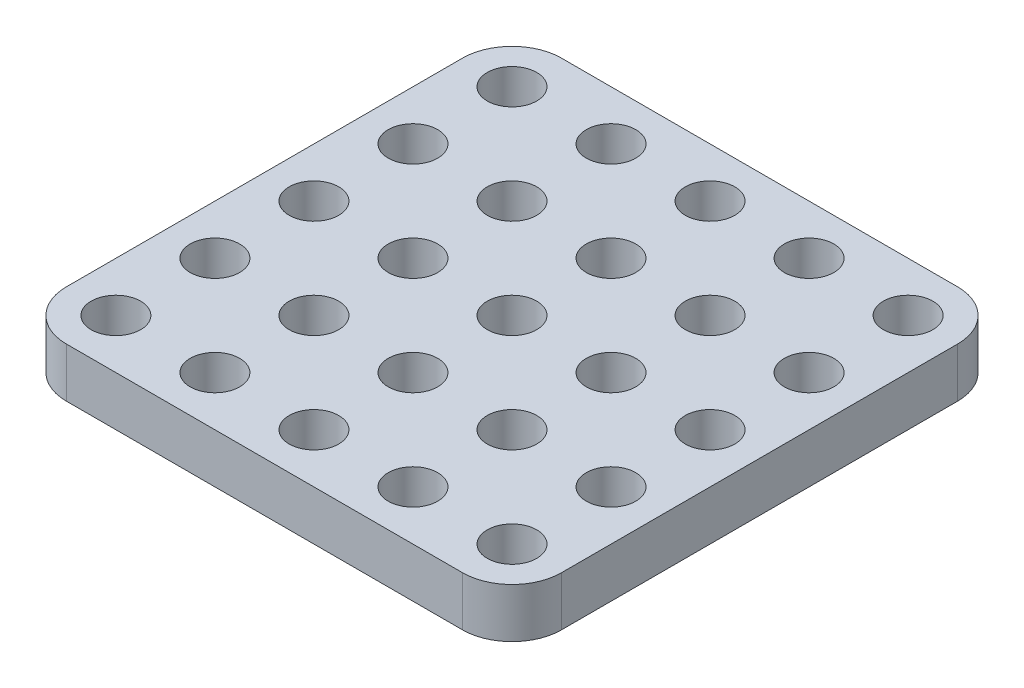
ISO-10303-21;
HEADER;
FILE_DESCRIPTION(('STEP AP214'),'2;1');
FILE_NAME('part.step','',(''),(''),'','','');
FILE_SCHEMA(('AUTOMOTIVE_DESIGN { 1 0 10303 214 1 1 1 1 }'));
ENDSEC;
DATA;
#1=APPLICATION_CONTEXT('core data for automotive mechanical design processes');
#2=APPLICATION_PROTOCOL_DEFINITION('international standard','automotive_design',2000,#1);
#3=PRODUCT_CONTEXT('',#1,'mechanical');
#4=PRODUCT('Part','Part','',(#3));
#5=PRODUCT_RELATED_PRODUCT_CATEGORY('part','',(#4));
#6=PRODUCT_DEFINITION_FORMATION('','',#4);
#7=PRODUCT_DEFINITION_CONTEXT('part definition',#1,'design');
#8=PRODUCT_DEFINITION('design','',#6,#7);
#9=PRODUCT_DEFINITION_SHAPE('','',#8);
#10=(LENGTH_UNIT() NAMED_UNIT(*) SI_UNIT(.MILLI.,.METRE.));
#11=(NAMED_UNIT(*) PLANE_ANGLE_UNIT() SI_UNIT($,.RADIAN.));
#12=(NAMED_UNIT(*) SI_UNIT($,.STERADIAN.) SOLID_ANGLE_UNIT());
#13=UNCERTAINTY_MEASURE_WITH_UNIT(LENGTH_MEASURE(1.E-05),#10,'distance_accuracy_value','');
#14=(GEOMETRIC_REPRESENTATION_CONTEXT(3) GLOBAL_UNCERTAINTY_ASSIGNED_CONTEXT((#13)) GLOBAL_UNIT_ASSIGNED_CONTEXT((#10,
#11,#12)) REPRESENTATION_CONTEXT('',''));
#15=CARTESIAN_POINT('',(0.,0.,0.));
#16=DIRECTION('',(0.,0.,1.));
#17=DIRECTION('',(1.,0.,0.));
#18=AXIS2_PLACEMENT_3D('',#15,#16,#17);
#19=CARTESIAN_POINT('',(20.,5.,-20.));
#20=DIRECTION('',(0.,-1.,0.));
#21=DIRECTION('',(0.,0.,-1.));
#22=AXIS2_PLACEMENT_3D('',#19,#20,#21);
#23=PLANE('',#22);
#24=CARTESIAN_POINT('',(20.,5.,-20.));
#25=DIRECTION('',(0.,1.,0.));
#26=DIRECTION('',(0.,0.,-1.));
#27=AXIS2_PLACEMENT_3D('',#24,#25,#26);
#28=CIRCLE('',#27,5.);
#29=CARTESIAN_POINT('',(25.,5.,-20.));
#30=VERTEX_POINT('',#29);
#31=CARTESIAN_POINT('',(20.,5.,-25.));
#32=VERTEX_POINT('',#31);
#33=EDGE_CURVE('E145',#30,#32,#28,.T.);
#34=ORIENTED_EDGE('',*,*,#33,.T.);
#35=DIRECTION('',(-1.,0.,0.));
#36=VECTOR('',#35,1.);
#37=CARTESIAN_POINT('',(20.,5.,-25.));
#38=LINE('',#37,#36);
#39=CARTESIAN_POINT('',(-20.,5.,-25.));
#40=VERTEX_POINT('',#39);
#41=EDGE_CURVE('E93',#32,#40,#38,.T.);
#42=ORIENTED_EDGE('',*,*,#41,.T.);
#43=CARTESIAN_POINT('',(-20.,5.,-20.));
#44=DIRECTION('',(0.,1.,0.));
#45=DIRECTION('',(0.,0.,-1.));
#46=AXIS2_PLACEMENT_3D('',#43,#44,#45);
#47=CIRCLE('',#46,5.);
#48=CARTESIAN_POINT('',(-25.,5.,-20.));
#49=VERTEX_POINT('',#48);
#50=EDGE_CURVE('E160',#40,#49,#47,.T.);
#51=ORIENTED_EDGE('',*,*,#50,.T.);
#52=DIRECTION('',(0.,0.,1.));
#53=VECTOR('',#52,1.);
#54=CARTESIAN_POINT('',(-25.,5.,20.));
#55=LINE('',#54,#53);
#56=CARTESIAN_POINT('',(-25.,5.,20.));
#57=VERTEX_POINT('',#56);
#58=EDGE_CURVE('E173',#49,#57,#55,.T.);
#59=ORIENTED_EDGE('',*,*,#58,.T.);
#60=CARTESIAN_POINT('',(-20.,5.,20.));
#61=DIRECTION('',(0.,1.,0.));
#62=DIRECTION('',(0.,0.,-1.));
#63=AXIS2_PLACEMENT_3D('',#60,#61,#62);
#64=CIRCLE('',#63,5.);
#65=CARTESIAN_POINT('',(-20.,5.,25.));
#66=VERTEX_POINT('',#65);
#67=EDGE_CURVE('E112',#57,#66,#64,.T.);
#68=ORIENTED_EDGE('',*,*,#67,.T.);
#69=DIRECTION('',(1.,0.,0.));
#70=VECTOR('',#69,1.);
#71=CARTESIAN_POINT('',(20.,5.,25.));
#72=LINE('',#71,#70);
#73=CARTESIAN_POINT('',(20.,5.,25.));
#74=VERTEX_POINT('',#73);
#75=EDGE_CURVE('E106',#66,#74,#72,.T.);
#76=ORIENTED_EDGE('',*,*,#75,.T.);
#77=CARTESIAN_POINT('',(20.,5.,20.));
#78=DIRECTION('',(0.,1.,0.));
#79=DIRECTION('',(0.,0.,-1.));
#80=AXIS2_PLACEMENT_3D('',#77,#78,#79);
#81=CIRCLE('',#80,5.);
#82=CARTESIAN_POINT('',(25.,5.,20.));
#83=VERTEX_POINT('',#82);
#84=EDGE_CURVE('E110',#74,#83,#81,.T.);
#85=ORIENTED_EDGE('',*,*,#84,.T.);
#86=DIRECTION('',(0.,0.,-1.));
#87=VECTOR('',#86,1.);
#88=CARTESIAN_POINT('',(25.,5.,20.));
#89=LINE('',#88,#87);
#90=EDGE_CURVE('E50',#83,#30,#89,.T.);
#91=ORIENTED_EDGE('',*,*,#90,.T.);
#92=EDGE_LOOP('',(#34,#42,#51,#59,#68,#76,#85,#91));
#93=FACE_BOUND('',#92,.T.);
#94=CARTESIAN_POINT('',(-20.,5.,-20.));
#95=DIRECTION('',(0.,1.,0.));
#96=DIRECTION('',(0.,0.,1.));
#97=AXIS2_PLACEMENT_3D('',#94,#95,#96);
#98=CIRCLE('',#97,2.5);
#99=CARTESIAN_POINT('',(-20.,5.,-17.5));
#100=VERTEX_POINT('',#99);
#101=EDGE_CURVE('E134',#100,#100,#98,.T.);
#102=ORIENTED_EDGE('',*,*,#101,.F.);
#103=EDGE_LOOP('',(#102));
#104=FACE_BOUND('',#103,.T.);
#105=CARTESIAN_POINT('',(-10.,5.,-20.0000000000001));
#106=DIRECTION('',(0.,1.,0.));
#107=DIRECTION('',(0.,0.,1.));
#108=AXIS2_PLACEMENT_3D('',#105,#106,#107);
#109=CIRCLE('',#108,2.5);
#110=CARTESIAN_POINT('',(-10.,5.,-17.5000000000001));
#111=VERTEX_POINT('',#110);
#112=EDGE_CURVE('E182',#111,#111,#109,.T.);
#113=ORIENTED_EDGE('',*,*,#112,.F.);
#114=EDGE_LOOP('',(#113));
#115=FACE_BOUND('',#114,.T.);
#116=CARTESIAN_POINT('',(0.,5.,-20.0000000000003));
#117=DIRECTION('',(0.,1.,0.));
#118=DIRECTION('',(0.,0.,1.));
#119=AXIS2_PLACEMENT_3D('',#116,#117,#118);
#120=CIRCLE('',#119,2.5);
#121=CARTESIAN_POINT('',(0.,5.,-17.5000000000003));
#122=VERTEX_POINT('',#121);
#123=EDGE_CURVE('E188',#122,#122,#120,.T.);
#124=ORIENTED_EDGE('',*,*,#123,.F.);
#125=EDGE_LOOP('',(#124));
#126=FACE_BOUND('',#125,.T.);
#127=CARTESIAN_POINT('',(9.99999999999999,5.,-20.0000000000004));
#128=DIRECTION('',(0.,1.,0.));
#129=DIRECTION('',(0.,0.,1.));
#130=AXIS2_PLACEMENT_3D('',#127,#128,#129);
#131=CIRCLE('',#130,2.5);
#132=CARTESIAN_POINT('',(9.99999999999999,5.,-17.5000000000004));
#133=VERTEX_POINT('',#132);
#134=EDGE_CURVE('E194',#133,#133,#131,.T.);
#135=ORIENTED_EDGE('',*,*,#134,.F.);
#136=EDGE_LOOP('',(#135));
#137=FACE_BOUND('',#136,.T.);
#138=CARTESIAN_POINT('',(20.,5.,-20.0000000000006));
#139=DIRECTION('',(0.,1.,0.));
#140=DIRECTION('',(0.,0.,1.));
#141=AXIS2_PLACEMENT_3D('',#138,#139,#140);
#142=CIRCLE('',#141,2.5);
#143=CARTESIAN_POINT('',(20.,5.,-17.5000000000006));
#144=VERTEX_POINT('',#143);
#145=EDGE_CURVE('E200',#144,#144,#142,.T.);
#146=ORIENTED_EDGE('',*,*,#145,.F.);
#147=EDGE_LOOP('',(#146));
#148=FACE_BOUND('',#147,.T.);
#149=CARTESIAN_POINT('',(-9.9999999999999,5.,-10.0000000000001));
#150=DIRECTION('',(0.,1.,0.));
#151=DIRECTION('',(0.,0.,1.));
#152=AXIS2_PLACEMENT_3D('',#149,#150,#151);
#153=CIRCLE('',#152,2.5);
#154=CARTESIAN_POINT('',(-9.9999999999999,5.,-7.50000000000014));
#155=VERTEX_POINT('',#154);
#156=EDGE_CURVE('E206',#155,#155,#153,.T.);
#157=ORIENTED_EDGE('',*,*,#156,.F.);
#158=EDGE_LOOP('',(#157));
#159=FACE_BOUND('',#158,.T.);
#160=CARTESIAN_POINT('',(0.,5.,-10.0000000000003));
#161=DIRECTION('',(0.,1.,0.));
#162=DIRECTION('',(0.,0.,1.));
#163=AXIS2_PLACEMENT_3D('',#160,#161,#162);
#164=CIRCLE('',#163,2.5);
#165=CARTESIAN_POINT('',(0.,5.,-7.50000000000028));
#166=VERTEX_POINT('',#165);
#167=EDGE_CURVE('E212',#166,#166,#164,.T.);
#168=ORIENTED_EDGE('',*,*,#167,.F.);
#169=EDGE_LOOP('',(#168));
#170=FACE_BOUND('',#169,.T.);
#171=CARTESIAN_POINT('',(10.0000000000001,5.,-10.0000000000004));
#172=DIRECTION('',(0.,1.,0.));
#173=DIRECTION('',(0.,0.,1.));
#174=AXIS2_PLACEMENT_3D('',#171,#172,#173);
#175=CIRCLE('',#174,2.5);
#176=CARTESIAN_POINT('',(10.0000000000001,5.,-7.50000000000042));
#177=VERTEX_POINT('',#176);
#178=EDGE_CURVE('E218',#177,#177,#175,.T.);
#179=ORIENTED_EDGE('',*,*,#178,.F.);
#180=EDGE_LOOP('',(#179));
#181=FACE_BOUND('',#180,.T.);
#182=CARTESIAN_POINT('',(20.0000000000001,5.,-10.0000000000006));
#183=DIRECTION('',(0.,1.,0.));
#184=DIRECTION('',(0.,0.,1.));
#185=AXIS2_PLACEMENT_3D('',#182,#183,#184);
#186=CIRCLE('',#185,2.5);
#187=CARTESIAN_POINT('',(20.0000000000001,5.,-7.50000000000056));
#188=VERTEX_POINT('',#187);
#189=EDGE_CURVE('E224',#188,#188,#186,.T.);
#190=ORIENTED_EDGE('',*,*,#189,.F.);
#191=EDGE_LOOP('',(#190));
#192=FACE_BOUND('',#191,.T.);
#193=CARTESIAN_POINT('',(-9.99999999999979,5.,-1.42247325030098E-13));
#194=DIRECTION('',(0.,1.,0.));
#195=DIRECTION('',(0.,0.,1.));
#196=AXIS2_PLACEMENT_3D('',#193,#194,#195);
#197=CIRCLE('',#196,2.5);
#198=CARTESIAN_POINT('',(-9.99999999999979,5.,2.49999999999986));
#199=VERTEX_POINT('',#198);
#200=EDGE_CURVE('E230',#199,#199,#197,.T.);
#201=ORIENTED_EDGE('',*,*,#200,.F.);
#202=EDGE_LOOP('',(#201));
#203=FACE_BOUND('',#202,.T.);
#204=CARTESIAN_POINT('',(2.0122792321331E-13,5.,-2.84494650060196E-13));
#205=DIRECTION('',(0.,1.,0.));
#206=DIRECTION('',(0.,0.,1.));
#207=AXIS2_PLACEMENT_3D('',#204,#205,#206);
#208=CIRCLE('',#207,2.5);
#209=CARTESIAN_POINT('',(2.0122792321331E-13,5.,2.49999999999972));
#210=VERTEX_POINT('',#209);
#211=EDGE_CURVE('E236',#210,#210,#208,.T.);
#212=ORIENTED_EDGE('',*,*,#211,.F.);
#213=EDGE_LOOP('',(#212));
#214=FACE_BOUND('',#213,.T.);
#215=CARTESIAN_POINT('',(10.0000000000002,5.,-4.23272528138341E-13));
#216=DIRECTION('',(0.,1.,0.));
#217=DIRECTION('',(0.,0.,1.));
#218=AXIS2_PLACEMENT_3D('',#215,#216,#217);
#219=CIRCLE('',#218,2.5);
#220=CARTESIAN_POINT('',(10.0000000000002,5.,2.49999999999958));
#221=VERTEX_POINT('',#220);
#222=EDGE_CURVE('E242',#221,#221,#219,.T.);
#223=ORIENTED_EDGE('',*,*,#222,.F.);
#224=EDGE_LOOP('',(#223));
#225=FACE_BOUND('',#224,.T.);
#226=CARTESIAN_POINT('',(20.0000000000002,5.,-5.62050406216485E-13));
#227=DIRECTION('',(0.,1.,0.));
#228=DIRECTION('',(0.,0.,1.));
#229=AXIS2_PLACEMENT_3D('',#226,#227,#228);
#230=CIRCLE('',#229,2.5);
#231=CARTESIAN_POINT('',(20.0000000000002,5.,2.49999999999944));
#232=VERTEX_POINT('',#231);
#233=EDGE_CURVE('E248',#232,#232,#230,.T.);
#234=ORIENTED_EDGE('',*,*,#233,.F.);
#235=EDGE_LOOP('',(#234));
#236=FACE_BOUND('',#235,.T.);
#237=CARTESIAN_POINT('',(-9.99999999999969,5.,9.99999999999986));
#238=DIRECTION('',(0.,1.,0.));
#239=DIRECTION('',(0.,0.,1.));
#240=AXIS2_PLACEMENT_3D('',#237,#238,#239);
#241=CIRCLE('',#240,2.5);
#242=CARTESIAN_POINT('',(-9.99999999999969,5.,12.4999999999999));
#243=VERTEX_POINT('',#242);
#244=EDGE_CURVE('E254',#243,#243,#241,.T.);
#245=ORIENTED_EDGE('',*,*,#244,.F.);
#246=EDGE_LOOP('',(#245));
#247=FACE_BOUND('',#246,.T.);
#248=CARTESIAN_POINT('',(3.08780778723872E-13,5.,9.99999999999971));
#249=DIRECTION('',(0.,1.,0.));
#250=DIRECTION('',(0.,0.,1.));
#251=AXIS2_PLACEMENT_3D('',#248,#249,#250);
#252=CIRCLE('',#251,2.5);
#253=CARTESIAN_POINT('',(3.08780778723872E-13,5.,12.4999999999997));
#254=VERTEX_POINT('',#253);
#255=EDGE_CURVE('E260',#254,#254,#252,.T.);
#256=ORIENTED_EDGE('',*,*,#255,.F.);
#257=EDGE_LOOP('',(#256));
#258=FACE_BOUND('',#257,.T.);
#259=CARTESIAN_POINT('',(10.0000000000003,5.,9.99999999999958));
#260=DIRECTION('',(0.,1.,0.));
#261=DIRECTION('',(0.,0.,1.));
#262=AXIS2_PLACEMENT_3D('',#259,#260,#261);
#263=CIRCLE('',#262,2.5);
#264=CARTESIAN_POINT('',(10.0000000000003,5.,12.4999999999996));
#265=VERTEX_POINT('',#264);
#266=EDGE_CURVE('E266',#265,#265,#263,.T.);
#267=ORIENTED_EDGE('',*,*,#266,.F.);
#268=EDGE_LOOP('',(#267));
#269=FACE_BOUND('',#268,.T.);
#270=CARTESIAN_POINT('',(20.0000000000003,5.,9.99999999999944));
#271=DIRECTION('',(0.,1.,0.));
#272=DIRECTION('',(0.,0.,1.));
#273=AXIS2_PLACEMENT_3D('',#270,#271,#272);
#274=CIRCLE('',#273,2.5);
#275=CARTESIAN_POINT('',(20.0000000000003,5.,12.4999999999994));
#276=VERTEX_POINT('',#275);
#277=EDGE_CURVE('E272',#276,#276,#274,.T.);
#278=ORIENTED_EDGE('',*,*,#277,.F.);
#279=EDGE_LOOP('',(#278));
#280=FACE_BOUND('',#279,.T.);
#281=CARTESIAN_POINT('',(-9.99999999999958,5.,19.9999999999999));
#282=DIRECTION('',(0.,1.,0.));
#283=DIRECTION('',(0.,0.,1.));
#284=AXIS2_PLACEMENT_3D('',#281,#282,#283);
#285=CIRCLE('',#284,2.5);
#286=CARTESIAN_POINT('',(-9.99999999999958,5.,22.4999999999999));
#287=VERTEX_POINT('',#286);
#288=EDGE_CURVE('E278',#287,#287,#285,.T.);
#289=ORIENTED_EDGE('',*,*,#288,.F.);
#290=EDGE_LOOP('',(#289));
#291=FACE_BOUND('',#290,.T.);
#292=CARTESIAN_POINT('',(4.1286418728248E-13,5.,19.9999999999997));
#293=DIRECTION('',(0.,1.,0.));
#294=DIRECTION('',(0.,0.,1.));
#295=AXIS2_PLACEMENT_3D('',#292,#293,#294);
#296=CIRCLE('',#295,2.5);
#297=CARTESIAN_POINT('',(4.1286418728248E-13,5.,22.4999999999997));
#298=VERTEX_POINT('',#297);
#299=EDGE_CURVE('E284',#298,#298,#296,.T.);
#300=ORIENTED_EDGE('',*,*,#299,.F.);
#301=EDGE_LOOP('',(#300));
#302=FACE_BOUND('',#301,.T.);
#303=CARTESIAN_POINT('',(10.0000000000004,5.,19.9999999999996));
#304=DIRECTION('',(0.,1.,0.));
#305=DIRECTION('',(0.,0.,1.));
#306=AXIS2_PLACEMENT_3D('',#303,#304,#305);
#307=CIRCLE('',#306,2.5);
#308=CARTESIAN_POINT('',(10.0000000000004,5.,22.4999999999996));
#309=VERTEX_POINT('',#308);
#310=EDGE_CURVE('E290',#309,#309,#307,.T.);
#311=ORIENTED_EDGE('',*,*,#310,.F.);
#312=EDGE_LOOP('',(#311));
#313=FACE_BOUND('',#312,.T.);
#314=CARTESIAN_POINT('',(20.0000000000004,5.,19.9999999999994));
#315=DIRECTION('',(0.,1.,0.));
#316=DIRECTION('',(0.,0.,1.));
#317=AXIS2_PLACEMENT_3D('',#314,#315,#316);
#318=CIRCLE('',#317,2.5);
#319=CARTESIAN_POINT('',(20.0000000000004,5.,22.4999999999994));
#320=VERTEX_POINT('',#319);
#321=EDGE_CURVE('E296',#320,#320,#318,.T.);
#322=ORIENTED_EDGE('',*,*,#321,.F.);
#323=EDGE_LOOP('',(#322));
#324=FACE_BOUND('',#323,.T.);
#325=CARTESIAN_POINT('',(-19.9999999999999,5.,-10.));
#326=DIRECTION('',(0.,1.,0.));
#327=DIRECTION('',(0.,0.,1.));
#328=AXIS2_PLACEMENT_3D('',#325,#326,#327);
#329=CIRCLE('',#328,2.5);
#330=CARTESIAN_POINT('',(-19.9999999999999,5.,-7.5));
#331=VERTEX_POINT('',#330);
#332=EDGE_CURVE('E302',#331,#331,#329,.T.);
#333=ORIENTED_EDGE('',*,*,#332,.F.);
#334=EDGE_LOOP('',(#333));
#335=FACE_BOUND('',#334,.T.);
#336=CARTESIAN_POINT('',(-19.9999999999998,5.,0.));
#337=DIRECTION('',(0.,1.,0.));
#338=DIRECTION('',(0.,0.,1.));
#339=AXIS2_PLACEMENT_3D('',#336,#337,#338);
#340=CIRCLE('',#339,2.5);
#341=CARTESIAN_POINT('',(-19.9999999999998,5.,2.5));
#342=VERTEX_POINT('',#341);
#343=EDGE_CURVE('E308',#342,#342,#340,.T.);
#344=ORIENTED_EDGE('',*,*,#343,.F.);
#345=EDGE_LOOP('',(#344));
#346=FACE_BOUND('',#345,.T.);
#347=CARTESIAN_POINT('',(-19.9999999999997,5.,9.99999999999999));
#348=DIRECTION('',(0.,1.,0.));
#349=DIRECTION('',(0.,0.,1.));
#350=AXIS2_PLACEMENT_3D('',#347,#348,#349);
#351=CIRCLE('',#350,2.5);
#352=CARTESIAN_POINT('',(-19.9999999999997,5.,12.5));
#353=VERTEX_POINT('',#352);
#354=EDGE_CURVE('E314',#353,#353,#351,.T.);
#355=ORIENTED_EDGE('',*,*,#354,.F.);
#356=EDGE_LOOP('',(#355));
#357=FACE_BOUND('',#356,.T.);
#358=CARTESIAN_POINT('',(-19.9999999999996,5.,20.));
#359=DIRECTION('',(0.,1.,0.));
#360=DIRECTION('',(0.,0.,1.));
#361=AXIS2_PLACEMENT_3D('',#358,#359,#360);
#362=CIRCLE('',#361,2.5);
#363=CARTESIAN_POINT('',(-19.9999999999996,5.,22.5));
#364=VERTEX_POINT('',#363);
#365=EDGE_CURVE('E320',#364,#364,#362,.T.);
#366=ORIENTED_EDGE('',*,*,#365,.F.);
#367=EDGE_LOOP('',(#366));
#368=FACE_BOUND('',#367,.T.);
#369=ADVANCED_FACE('F33',(#93,#104,#115,#126,#137,#148,#159,#170,#181,#192,#203,#214,#225,#236,
#247,#258,#269,#280,#291,#302,#313,#324,#335,#346,#357,#368),#23,.F.);
#370=CARTESIAN_POINT('',(20.,0.,-20.));
#371=DIRECTION('',(0.,-1.,0.));
#372=DIRECTION('',(0.,0.,-1.));
#373=AXIS2_PLACEMENT_3D('',#370,#371,#372);
#374=PLANE('',#373);
#375=CARTESIAN_POINT('',(-19.9999999999997,0.,9.99999999999999));
#376=DIRECTION('',(0.,1.,0.));
#377=DIRECTION('',(0.,0.,1.));
#378=AXIS2_PLACEMENT_3D('',#375,#376,#377);
#379=CIRCLE('',#378,2.5);
#380=CARTESIAN_POINT('',(-19.9999999999997,0.,12.5));
#381=VERTEX_POINT('',#380);
#382=EDGE_CURVE('E317',#381,#381,#379,.T.);
#383=ORIENTED_EDGE('',*,*,#382,.T.);
#384=EDGE_LOOP('',(#383));
#385=FACE_BOUND('',#384,.T.);
#386=CARTESIAN_POINT('',(-19.9999999999999,0.,-10.));
#387=DIRECTION('',(0.,1.,0.));
#388=DIRECTION('',(0.,0.,1.));
#389=AXIS2_PLACEMENT_3D('',#386,#387,#388);
#390=CIRCLE('',#389,2.5);
#391=CARTESIAN_POINT('',(-19.9999999999999,0.,-7.5));
#392=VERTEX_POINT('',#391);
#393=EDGE_CURVE('E305',#392,#392,#390,.T.);
#394=ORIENTED_EDGE('',*,*,#393,.T.);
#395=EDGE_LOOP('',(#394));
#396=FACE_BOUND('',#395,.T.);
#397=CARTESIAN_POINT('',(10.0000000000004,0.,19.9999999999996));
#398=DIRECTION('',(0.,1.,0.));
#399=DIRECTION('',(0.,0.,1.));
#400=AXIS2_PLACEMENT_3D('',#397,#398,#399);
#401=CIRCLE('',#400,2.5);
#402=CARTESIAN_POINT('',(10.0000000000004,0.,22.4999999999996));
#403=VERTEX_POINT('',#402);
#404=EDGE_CURVE('E293',#403,#403,#401,.T.);
#405=ORIENTED_EDGE('',*,*,#404,.T.);
#406=EDGE_LOOP('',(#405));
#407=FACE_BOUND('',#406,.T.);
#408=CARTESIAN_POINT('',(-9.99999999999958,0.,19.9999999999999));
#409=DIRECTION('',(0.,1.,0.));
#410=DIRECTION('',(0.,0.,1.));
#411=AXIS2_PLACEMENT_3D('',#408,#409,#410);
#412=CIRCLE('',#411,2.5);
#413=CARTESIAN_POINT('',(-9.99999999999958,0.,22.4999999999999));
#414=VERTEX_POINT('',#413);
#415=EDGE_CURVE('E281',#414,#414,#412,.T.);
#416=ORIENTED_EDGE('',*,*,#415,.T.);
#417=EDGE_LOOP('',(#416));
#418=FACE_BOUND('',#417,.T.);
#419=CARTESIAN_POINT('',(10.0000000000003,0.,9.99999999999958));
#420=DIRECTION('',(0.,1.,0.));
#421=DIRECTION('',(0.,0.,1.));
#422=AXIS2_PLACEMENT_3D('',#419,#420,#421);
#423=CIRCLE('',#422,2.5);
#424=CARTESIAN_POINT('',(10.0000000000003,0.,12.4999999999996));
#425=VERTEX_POINT('',#424);
#426=EDGE_CURVE('E269',#425,#425,#423,.T.);
#427=ORIENTED_EDGE('',*,*,#426,.T.);
#428=EDGE_LOOP('',(#427));
#429=FACE_BOUND('',#428,.T.);
#430=CARTESIAN_POINT('',(-9.99999999999969,0.,9.99999999999986));
#431=DIRECTION('',(0.,1.,0.));
#432=DIRECTION('',(0.,0.,1.));
#433=AXIS2_PLACEMENT_3D('',#430,#431,#432);
#434=CIRCLE('',#433,2.5);
#435=CARTESIAN_POINT('',(-9.99999999999969,0.,12.4999999999999));
#436=VERTEX_POINT('',#435);
#437=EDGE_CURVE('E257',#436,#436,#434,.T.);
#438=ORIENTED_EDGE('',*,*,#437,.T.);
#439=EDGE_LOOP('',(#438));
#440=FACE_BOUND('',#439,.T.);
#441=CARTESIAN_POINT('',(10.0000000000002,0.,-4.23272528138341E-13));
#442=DIRECTION('',(0.,1.,0.));
#443=DIRECTION('',(0.,0.,1.));
#444=AXIS2_PLACEMENT_3D('',#441,#442,#443);
#445=CIRCLE('',#444,2.5);
#446=CARTESIAN_POINT('',(10.0000000000002,0.,2.49999999999958));
#447=VERTEX_POINT('',#446);
#448=EDGE_CURVE('E245',#447,#447,#445,.T.);
#449=ORIENTED_EDGE('',*,*,#448,.T.);
#450=EDGE_LOOP('',(#449));
#451=FACE_BOUND('',#450,.T.);
#452=CARTESIAN_POINT('',(-9.99999999999979,0.,-1.42247325030098E-13));
#453=DIRECTION('',(0.,1.,0.));
#454=DIRECTION('',(0.,0.,1.));
#455=AXIS2_PLACEMENT_3D('',#452,#453,#454);
#456=CIRCLE('',#455,2.5);
#457=CARTESIAN_POINT('',(-9.99999999999979,0.,2.49999999999986));
#458=VERTEX_POINT('',#457);
#459=EDGE_CURVE('E233',#458,#458,#456,.T.);
#460=ORIENTED_EDGE('',*,*,#459,.T.);
#461=EDGE_LOOP('',(#460));
#462=FACE_BOUND('',#461,.T.);
#463=CARTESIAN_POINT('',(10.0000000000001,0.,-10.0000000000004));
#464=DIRECTION('',(0.,1.,0.));
#465=DIRECTION('',(0.,0.,1.));
#466=AXIS2_PLACEMENT_3D('',#463,#464,#465);
#467=CIRCLE('',#466,2.5);
#468=CARTESIAN_POINT('',(10.0000000000001,0.,-7.50000000000042));
#469=VERTEX_POINT('',#468);
#470=EDGE_CURVE('E221',#469,#469,#467,.T.);
#471=ORIENTED_EDGE('',*,*,#470,.T.);
#472=EDGE_LOOP('',(#471));
#473=FACE_BOUND('',#472,.T.);
#474=CARTESIAN_POINT('',(-9.9999999999999,0.,-10.0000000000001));
#475=DIRECTION('',(0.,1.,0.));
#476=DIRECTION('',(0.,0.,1.));
#477=AXIS2_PLACEMENT_3D('',#474,#475,#476);
#478=CIRCLE('',#477,2.5);
#479=CARTESIAN_POINT('',(-9.9999999999999,0.,-7.50000000000014));
#480=VERTEX_POINT('',#479);
#481=EDGE_CURVE('E209',#480,#480,#478,.T.);
#482=ORIENTED_EDGE('',*,*,#481,.T.);
#483=EDGE_LOOP('',(#482));
#484=FACE_BOUND('',#483,.T.);
#485=CARTESIAN_POINT('',(9.99999999999999,0.,-20.0000000000004));
#486=DIRECTION('',(0.,1.,0.));
#487=DIRECTION('',(0.,0.,1.));
#488=AXIS2_PLACEMENT_3D('',#485,#486,#487);
#489=CIRCLE('',#488,2.5);
#490=CARTESIAN_POINT('',(9.99999999999999,0.,-17.5000000000004));
#491=VERTEX_POINT('',#490);
#492=EDGE_CURVE('E197',#491,#491,#489,.T.);
#493=ORIENTED_EDGE('',*,*,#492,.T.);
#494=EDGE_LOOP('',(#493));
#495=FACE_BOUND('',#494,.T.);
#496=CARTESIAN_POINT('',(-10.,0.,-20.0000000000001));
#497=DIRECTION('',(0.,1.,0.));
#498=DIRECTION('',(0.,0.,1.));
#499=AXIS2_PLACEMENT_3D('',#496,#497,#498);
#500=CIRCLE('',#499,2.5);
#501=CARTESIAN_POINT('',(-10.,0.,-17.5000000000001));
#502=VERTEX_POINT('',#501);
#503=EDGE_CURVE('E185',#502,#502,#500,.T.);
#504=ORIENTED_EDGE('',*,*,#503,.T.);
#505=EDGE_LOOP('',(#504));
#506=FACE_BOUND('',#505,.T.);
#507=CARTESIAN_POINT('',(20.,0.,-20.));
#508=DIRECTION('',(0.,1.,0.));
#509=DIRECTION('',(0.,0.,-1.));
#510=AXIS2_PLACEMENT_3D('',#507,#508,#509);
#511=CIRCLE('',#510,5.);
#512=CARTESIAN_POINT('',(25.,0.,-20.));
#513=VERTEX_POINT('',#512);
#514=CARTESIAN_POINT('',(20.,0.,-25.));
#515=VERTEX_POINT('',#514);
#516=EDGE_CURVE('E130',#513,#515,#511,.T.);
#517=ORIENTED_EDGE('',*,*,#516,.F.);
#518=DIRECTION('',(0.,0.,-1.));
#519=VECTOR('',#518,1.);
#520=CARTESIAN_POINT('',(25.,0.,20.));
#521=LINE('',#520,#519);
#522=CARTESIAN_POINT('',(25.,0.,20.));
#523=VERTEX_POINT('',#522);
#524=EDGE_CURVE('E85',#523,#513,#521,.T.);
#525=ORIENTED_EDGE('',*,*,#524,.F.);
#526=CARTESIAN_POINT('',(20.,0.,20.));
#527=DIRECTION('',(0.,1.,0.));
#528=DIRECTION('',(0.,0.,-1.));
#529=AXIS2_PLACEMENT_3D('',#526,#527,#528);
#530=CIRCLE('',#529,5.);
#531=CARTESIAN_POINT('',(20.,0.,25.));
#532=VERTEX_POINT('',#531);
#533=EDGE_CURVE('E79',#532,#523,#530,.T.);
#534=ORIENTED_EDGE('',*,*,#533,.F.);
#535=DIRECTION('',(1.,0.,0.));
#536=VECTOR('',#535,1.);
#537=CARTESIAN_POINT('',(20.,0.,25.));
#538=LINE('',#537,#536);
#539=CARTESIAN_POINT('',(-20.,0.,25.));
#540=VERTEX_POINT('',#539);
#541=EDGE_CURVE('E120',#540,#532,#538,.T.);
#542=ORIENTED_EDGE('',*,*,#541,.F.);
#543=CARTESIAN_POINT('',(-20.,0.,20.));
#544=DIRECTION('',(0.,1.,0.));
#545=DIRECTION('',(0.,0.,-1.));
#546=AXIS2_PLACEMENT_3D('',#543,#544,#545);
#547=CIRCLE('',#546,5.);
#548=CARTESIAN_POINT('',(-25.,0.,20.));
#549=VERTEX_POINT('',#548);
#550=EDGE_CURVE('E140',#549,#540,#547,.T.);
#551=ORIENTED_EDGE('',*,*,#550,.F.);
#552=DIRECTION('',(0.,0.,1.));
#553=VECTOR('',#552,1.);
#554=CARTESIAN_POINT('',(-25.,0.,20.));
#555=LINE('',#554,#553);
#556=CARTESIAN_POINT('',(-25.,0.,-20.));
#557=VERTEX_POINT('',#556);
#558=EDGE_CURVE('E138',#557,#549,#555,.T.);
#559=ORIENTED_EDGE('',*,*,#558,.F.);
#560=CARTESIAN_POINT('',(-20.,0.,-20.));
#561=DIRECTION('',(0.,1.,0.));
#562=DIRECTION('',(0.,0.,-1.));
#563=AXIS2_PLACEMENT_3D('',#560,#561,#562);
#564=CIRCLE('',#563,5.);
#565=CARTESIAN_POINT('',(-20.,0.,-25.));
#566=VERTEX_POINT('',#565);
#567=EDGE_CURVE('E136',#566,#557,#564,.T.);
#568=ORIENTED_EDGE('',*,*,#567,.F.);
#569=DIRECTION('',(-1.,0.,0.));
#570=VECTOR('',#569,1.);
#571=CARTESIAN_POINT('',(20.,0.,-25.));
#572=LINE('',#571,#570);
#573=EDGE_CURVE('E133',#515,#566,#572,.T.);
#574=ORIENTED_EDGE('',*,*,#573,.F.);
#575=EDGE_LOOP('',(#517,#525,#534,#542,#551,#559,#568,#574));
#576=FACE_BOUND('',#575,.T.);
#577=CARTESIAN_POINT('',(-20.,0.,-20.));
#578=DIRECTION('',(0.,1.,0.));
#579=DIRECTION('',(0.,0.,1.));
#580=AXIS2_PLACEMENT_3D('',#577,#578,#579);
#581=CIRCLE('',#580,2.5);
#582=CARTESIAN_POINT('',(-20.,0.,-17.5));
#583=VERTEX_POINT('',#582);
#584=EDGE_CURVE('E179',#583,#583,#581,.T.);
#585=ORIENTED_EDGE('',*,*,#584,.T.);
#586=EDGE_LOOP('',(#585));
#587=FACE_BOUND('',#586,.T.);
#588=CARTESIAN_POINT('',(0.,0.,-20.0000000000003));
#589=DIRECTION('',(0.,1.,0.));
#590=DIRECTION('',(0.,0.,1.));
#591=AXIS2_PLACEMENT_3D('',#588,#589,#590);
#592=CIRCLE('',#591,2.5);
#593=CARTESIAN_POINT('',(0.,0.,-17.5000000000003));
#594=VERTEX_POINT('',#593);
#595=EDGE_CURVE('E191',#594,#594,#592,.T.);
#596=ORIENTED_EDGE('',*,*,#595,.T.);
#597=EDGE_LOOP('',(#596));
#598=FACE_BOUND('',#597,.T.);
#599=CARTESIAN_POINT('',(20.,0.,-20.0000000000006));
#600=DIRECTION('',(0.,1.,0.));
#601=DIRECTION('',(0.,0.,1.));
#602=AXIS2_PLACEMENT_3D('',#599,#600,#601);
#603=CIRCLE('',#602,2.5);
#604=CARTESIAN_POINT('',(20.,0.,-17.5000000000006));
#605=VERTEX_POINT('',#604);
#606=EDGE_CURVE('E203',#605,#605,#603,.T.);
#607=ORIENTED_EDGE('',*,*,#606,.T.);
#608=EDGE_LOOP('',(#607));
#609=FACE_BOUND('',#608,.T.);
#610=CARTESIAN_POINT('',(0.,0.,-10.0000000000003));
#611=DIRECTION('',(0.,1.,0.));
#612=DIRECTION('',(0.,0.,1.));
#613=AXIS2_PLACEMENT_3D('',#610,#611,#612);
#614=CIRCLE('',#613,2.5);
#615=CARTESIAN_POINT('',(0.,0.,-7.50000000000028));
#616=VERTEX_POINT('',#615);
#617=EDGE_CURVE('E215',#616,#616,#614,.T.);
#618=ORIENTED_EDGE('',*,*,#617,.T.);
#619=EDGE_LOOP('',(#618));
#620=FACE_BOUND('',#619,.T.);
#621=CARTESIAN_POINT('',(20.0000000000001,0.,-10.0000000000006));
#622=DIRECTION('',(0.,1.,0.));
#623=DIRECTION('',(0.,0.,1.));
#624=AXIS2_PLACEMENT_3D('',#621,#622,#623);
#625=CIRCLE('',#624,2.5);
#626=CARTESIAN_POINT('',(20.0000000000001,0.,-7.50000000000056));
#627=VERTEX_POINT('',#626);
#628=EDGE_CURVE('E227',#627,#627,#625,.T.);
#629=ORIENTED_EDGE('',*,*,#628,.T.);
#630=EDGE_LOOP('',(#629));
#631=FACE_BOUND('',#630,.T.);
#632=CARTESIAN_POINT('',(2.0122792321331E-13,0.,-2.84494650060196E-13));
#633=DIRECTION('',(0.,1.,0.));
#634=DIRECTION('',(0.,0.,1.));
#635=AXIS2_PLACEMENT_3D('',#632,#633,#634);
#636=CIRCLE('',#635,2.5);
#637=CARTESIAN_POINT('',(2.0122792321331E-13,0.,2.49999999999972));
#638=VERTEX_POINT('',#637);
#639=EDGE_CURVE('E239',#638,#638,#636,.T.);
#640=ORIENTED_EDGE('',*,*,#639,.T.);
#641=EDGE_LOOP('',(#640));
#642=FACE_BOUND('',#641,.T.);
#643=CARTESIAN_POINT('',(20.0000000000002,0.,-5.62050406216485E-13));
#644=DIRECTION('',(0.,1.,0.));
#645=DIRECTION('',(0.,0.,1.));
#646=AXIS2_PLACEMENT_3D('',#643,#644,#645);
#647=CIRCLE('',#646,2.5);
#648=CARTESIAN_POINT('',(20.0000000000002,0.,2.49999999999944));
#649=VERTEX_POINT('',#648);
#650=EDGE_CURVE('E251',#649,#649,#647,.T.);
#651=ORIENTED_EDGE('',*,*,#650,.T.);
#652=EDGE_LOOP('',(#651));
#653=FACE_BOUND('',#652,.T.);
#654=CARTESIAN_POINT('',(3.08780778723872E-13,0.,9.99999999999971));
#655=DIRECTION('',(0.,1.,0.));
#656=DIRECTION('',(0.,0.,1.));
#657=AXIS2_PLACEMENT_3D('',#654,#655,#656);
#658=CIRCLE('',#657,2.5);
#659=CARTESIAN_POINT('',(3.08780778723872E-13,0.,12.4999999999997));
#660=VERTEX_POINT('',#659);
#661=EDGE_CURVE('E263',#660,#660,#658,.T.);
#662=ORIENTED_EDGE('',*,*,#661,.T.);
#663=EDGE_LOOP('',(#662));
#664=FACE_BOUND('',#663,.T.);
#665=CARTESIAN_POINT('',(20.0000000000003,0.,9.99999999999944));
#666=DIRECTION('',(0.,1.,0.));
#667=DIRECTION('',(0.,0.,1.));
#668=AXIS2_PLACEMENT_3D('',#665,#666,#667);
#669=CIRCLE('',#668,2.5);
#670=CARTESIAN_POINT('',(20.0000000000003,0.,12.4999999999994));
#671=VERTEX_POINT('',#670);
#672=EDGE_CURVE('E275',#671,#671,#669,.T.);
#673=ORIENTED_EDGE('',*,*,#672,.T.);
#674=EDGE_LOOP('',(#673));
#675=FACE_BOUND('',#674,.T.);
#676=CARTESIAN_POINT('',(4.1286418728248E-13,0.,19.9999999999997));
#677=DIRECTION('',(0.,1.,0.));
#678=DIRECTION('',(0.,0.,1.));
#679=AXIS2_PLACEMENT_3D('',#676,#677,#678);
#680=CIRCLE('',#679,2.5);
#681=CARTESIAN_POINT('',(4.1286418728248E-13,0.,22.4999999999997));
#682=VERTEX_POINT('',#681);
#683=EDGE_CURVE('E287',#682,#682,#680,.T.);
#684=ORIENTED_EDGE('',*,*,#683,.T.);
#685=EDGE_LOOP('',(#684));
#686=FACE_BOUND('',#685,.T.);
#687=CARTESIAN_POINT('',(20.0000000000004,0.,19.9999999999994));
#688=DIRECTION('',(0.,1.,0.));
#689=DIRECTION('',(0.,0.,1.));
#690=AXIS2_PLACEMENT_3D('',#687,#688,#689);
#691=CIRCLE('',#690,2.5);
#692=CARTESIAN_POINT('',(20.0000000000004,0.,22.4999999999994));
#693=VERTEX_POINT('',#692);
#694=EDGE_CURVE('E299',#693,#693,#691,.T.);
#695=ORIENTED_EDGE('',*,*,#694,.T.);
#696=EDGE_LOOP('',(#695));
#697=FACE_BOUND('',#696,.T.);
#698=CARTESIAN_POINT('',(-19.9999999999998,0.,0.));
#699=DIRECTION('',(0.,1.,0.));
#700=DIRECTION('',(0.,0.,1.));
#701=AXIS2_PLACEMENT_3D('',#698,#699,#700);
#702=CIRCLE('',#701,2.5);
#703=CARTESIAN_POINT('',(-19.9999999999998,0.,2.5));
#704=VERTEX_POINT('',#703);
#705=EDGE_CURVE('E311',#704,#704,#702,.T.);
#706=ORIENTED_EDGE('',*,*,#705,.T.);
#707=EDGE_LOOP('',(#706));
#708=FACE_BOUND('',#707,.T.);
#709=CARTESIAN_POINT('',(-19.9999999999996,0.,20.));
#710=DIRECTION('',(0.,1.,0.));
#711=DIRECTION('',(0.,0.,1.));
#712=AXIS2_PLACEMENT_3D('',#709,#710,#711);
#713=CIRCLE('',#712,2.5);
#714=CARTESIAN_POINT('',(-19.9999999999996,0.,22.5));
#715=VERTEX_POINT('',#714);
#716=EDGE_CURVE('E323',#715,#715,#713,.T.);
#717=ORIENTED_EDGE('',*,*,#716,.T.);
#718=EDGE_LOOP('',(#717));
#719=FACE_BOUND('',#718,.T.);
#720=ADVANCED_FACE('F164',(#385,#396,#407,#418,#429,#440,#451,#462,#473,#484,#495,#506,#576,
#587,#598,#609,#620,#631,#642,#653,#664,#675,#686,#697,#708,#719),#374,.T.);
#721=CARTESIAN_POINT('',(20.,5.,-20.));
#722=DIRECTION('',(0.,-1.,0.));
#723=DIRECTION('',(0.,0.,-1.));
#724=AXIS2_PLACEMENT_3D('',#721,#722,#723);
#725=CYLINDRICAL_SURFACE('',#724,5.);
#726=ORIENTED_EDGE('',*,*,#516,.T.);
#727=DIRECTION('',(0.,-1.,0.));
#728=VECTOR('',#727,1.);
#729=CARTESIAN_POINT('',(20.,5.,-25.));
#730=LINE('',#729,#728);
#731=EDGE_CURVE('E11',#32,#515,#730,.T.);
#732=ORIENTED_EDGE('',*,*,#731,.F.);
#733=ORIENTED_EDGE('',*,*,#33,.F.);
#734=DIRECTION('',(0.,-1.,0.));
#735=VECTOR('',#734,1.);
#736=CARTESIAN_POINT('',(25.,5.,-20.));
#737=LINE('',#736,#735);
#738=EDGE_CURVE('E126',#30,#513,#737,.T.);
#739=ORIENTED_EDGE('',*,*,#738,.T.);
#740=EDGE_LOOP('',(#726,#732,#733,#739));
#741=FACE_BOUND('',#740,.T.);
#742=ADVANCED_FACE('F35',(#741),#725,.T.);
#743=CARTESIAN_POINT('',(20.,5.,-25.));
#744=DIRECTION('',(0.,0.,1.));
#745=DIRECTION('',(1.,0.,0.));
#746=AXIS2_PLACEMENT_3D('',#743,#744,#745);
#747=PLANE('',#746);
#748=ORIENTED_EDGE('',*,*,#573,.T.);
#749=DIRECTION('',(0.,-1.,0.));
#750=VECTOR('',#749,1.);
#751=CARTESIAN_POINT('',(-20.,5.,-25.));
#752=LINE('',#751,#750);
#753=EDGE_CURVE('E42',#40,#566,#752,.T.);
#754=ORIENTED_EDGE('',*,*,#753,.F.);
#755=ORIENTED_EDGE('',*,*,#41,.F.);
#756=ORIENTED_EDGE('',*,*,#731,.T.);
#757=EDGE_LOOP('',(#748,#754,#755,#756));
#758=FACE_BOUND('',#757,.T.);
#759=ADVANCED_FACE('F355',(#758),#747,.F.);
#760=CARTESIAN_POINT('',(-20.,5.,-20.));
#761=DIRECTION('',(0.,-1.,0.));
#762=DIRECTION('',(0.,0.,-1.));
#763=AXIS2_PLACEMENT_3D('',#760,#761,#762);
#764=CYLINDRICAL_SURFACE('',#763,5.);
#765=ORIENTED_EDGE('',*,*,#567,.T.);
#766=DIRECTION('',(0.,-1.,0.));
#767=VECTOR('',#766,1.);
#768=CARTESIAN_POINT('',(-25.,5.,-20.));
#769=LINE('',#768,#767);
#770=EDGE_CURVE('E152',#49,#557,#769,.T.);
#771=ORIENTED_EDGE('',*,*,#770,.F.);
#772=ORIENTED_EDGE('',*,*,#50,.F.);
#773=ORIENTED_EDGE('',*,*,#753,.T.);
#774=EDGE_LOOP('',(#765,#771,#772,#773));
#775=FACE_BOUND('',#774,.T.);
#776=ADVANCED_FACE('F158',(#775),#764,.T.);
#777=CARTESIAN_POINT('',(-25.,5.,20.));
#778=DIRECTION('',(1.,0.,0.));
#779=DIRECTION('',(0.,0.,-1.));
#780=AXIS2_PLACEMENT_3D('',#777,#778,#779);
#781=PLANE('',#780);
#782=ORIENTED_EDGE('',*,*,#558,.T.);
#783=DIRECTION('',(0.,-1.,0.));
#784=VECTOR('',#783,1.);
#785=CARTESIAN_POINT('',(-25.,5.,20.));
#786=LINE('',#785,#784);
#787=EDGE_CURVE('E149',#57,#549,#786,.T.);
#788=ORIENTED_EDGE('',*,*,#787,.F.);
#789=ORIENTED_EDGE('',*,*,#58,.F.);
#790=ORIENTED_EDGE('',*,*,#770,.T.);
#791=EDGE_LOOP('',(#782,#788,#789,#790));
#792=FACE_BOUND('',#791,.T.);
#793=ADVANCED_FACE('F169',(#792),#781,.F.);
#794=CARTESIAN_POINT('',(-20.,5.,20.));
#795=DIRECTION('',(0.,-1.,0.));
#796=DIRECTION('',(0.,0.,-1.));
#797=AXIS2_PLACEMENT_3D('',#794,#795,#796);
#798=CYLINDRICAL_SURFACE('',#797,5.);
#799=ORIENTED_EDGE('',*,*,#550,.T.);
#800=DIRECTION('',(0.,-1.,0.));
#801=VECTOR('',#800,1.);
#802=CARTESIAN_POINT('',(-20.,5.,25.));
#803=LINE('',#802,#801);
#804=EDGE_CURVE('E121',#66,#540,#803,.T.);
#805=ORIENTED_EDGE('',*,*,#804,.F.);
#806=ORIENTED_EDGE('',*,*,#67,.F.);
#807=ORIENTED_EDGE('',*,*,#787,.T.);
#808=EDGE_LOOP('',(#799,#805,#806,#807));
#809=FACE_BOUND('',#808,.T.);
#810=ADVANCED_FACE('F172',(#809),#798,.T.);
#811=CARTESIAN_POINT('',(20.,5.,25.));
#812=DIRECTION('',(0.,0.,-1.));
#813=DIRECTION('',(-1.,0.,0.));
#814=AXIS2_PLACEMENT_3D('',#811,#812,#813);
#815=PLANE('',#814);
#816=ORIENTED_EDGE('',*,*,#541,.T.);
#817=DIRECTION('',(0.,-1.,0.));
#818=VECTOR('',#817,1.);
#819=CARTESIAN_POINT('',(20.,5.,25.));
#820=LINE('',#819,#818);
#821=EDGE_CURVE('E117',#74,#532,#820,.T.);
#822=ORIENTED_EDGE('',*,*,#821,.F.);
#823=ORIENTED_EDGE('',*,*,#75,.F.);
#824=ORIENTED_EDGE('',*,*,#804,.T.);
#825=EDGE_LOOP('',(#816,#822,#823,#824));
#826=FACE_BOUND('',#825,.T.);
#827=ADVANCED_FACE('F118',(#826),#815,.F.);
#828=CARTESIAN_POINT('',(20.,5.,20.));
#829=DIRECTION('',(0.,-1.,0.));
#830=DIRECTION('',(0.,0.,-1.));
#831=AXIS2_PLACEMENT_3D('',#828,#829,#830);
#832=CYLINDRICAL_SURFACE('',#831,5.);
#833=ORIENTED_EDGE('',*,*,#533,.T.);
#834=DIRECTION('',(0.,-1.,0.));
#835=VECTOR('',#834,1.);
#836=CARTESIAN_POINT('',(25.,5.,20.));
#837=LINE('',#836,#835);
#838=EDGE_CURVE('E122',#83,#523,#837,.T.);
#839=ORIENTED_EDGE('',*,*,#838,.F.);
#840=ORIENTED_EDGE('',*,*,#84,.F.);
#841=ORIENTED_EDGE('',*,*,#821,.T.);
#842=EDGE_LOOP('',(#833,#839,#840,#841));
#843=FACE_BOUND('',#842,.T.);
#844=ADVANCED_FACE('F124',(#843),#832,.T.);
#845=CARTESIAN_POINT('',(25.,5.,20.));
#846=DIRECTION('',(-1.,0.,0.));
#847=DIRECTION('',(0.,0.,1.));
#848=AXIS2_PLACEMENT_3D('',#845,#846,#847);
#849=PLANE('',#848);
#850=ORIENTED_EDGE('',*,*,#524,.T.);
#851=ORIENTED_EDGE('',*,*,#738,.F.);
#852=ORIENTED_EDGE('',*,*,#90,.F.);
#853=ORIENTED_EDGE('',*,*,#838,.T.);
#854=EDGE_LOOP('',(#850,#851,#852,#853));
#855=FACE_BOUND('',#854,.T.);
#856=ADVANCED_FACE('F343',(#855),#849,.F.);
#857=CARTESIAN_POINT('',(-20.,5.,-20.));
#858=DIRECTION('',(0.,-1.,0.));
#859=DIRECTION('',(0.,0.,-1.));
#860=AXIS2_PLACEMENT_3D('',#857,#858,#859);
#861=CYLINDRICAL_SURFACE('',#860,2.5);
#862=ORIENTED_EDGE('',*,*,#101,.T.);
#863=EDGE_LOOP('',(#862));
#864=FACE_BOUND('',#863,.T.);
#865=ORIENTED_EDGE('',*,*,#584,.F.);
#866=EDGE_LOOP('',(#865));
#867=FACE_BOUND('',#866,.T.);
#868=ADVANCED_FACE('F340',(#864,#867),#861,.F.);
#869=CARTESIAN_POINT('',(-10.,5.,-20.0000000000001));
#870=DIRECTION('',(0.,-1.,0.));
#871=DIRECTION('',(0.,0.,-1.));
#872=AXIS2_PLACEMENT_3D('',#869,#870,#871);
#873=CYLINDRICAL_SURFACE('',#872,2.5);
#874=ORIENTED_EDGE('',*,*,#112,.T.);
#875=EDGE_LOOP('',(#874));
#876=FACE_BOUND('',#875,.T.);
#877=ORIENTED_EDGE('',*,*,#503,.F.);
#878=EDGE_LOOP('',(#877));
#879=FACE_BOUND('',#878,.T.);
#880=ADVANCED_FACE('F419',(#876,#879),#873,.F.);
#881=CARTESIAN_POINT('',(0.,5.,-20.0000000000003));
#882=DIRECTION('',(0.,-1.,0.));
#883=DIRECTION('',(0.,0.,-1.));
#884=AXIS2_PLACEMENT_3D('',#881,#882,#883);
#885=CYLINDRICAL_SURFACE('',#884,2.5);
#886=ORIENTED_EDGE('',*,*,#123,.T.);
#887=EDGE_LOOP('',(#886));
#888=FACE_BOUND('',#887,.T.);
#889=ORIENTED_EDGE('',*,*,#595,.F.);
#890=EDGE_LOOP('',(#889));
#891=FACE_BOUND('',#890,.T.);
#892=ADVANCED_FACE('F427',(#888,#891),#885,.F.);
#893=CARTESIAN_POINT('',(9.99999999999999,5.,-20.0000000000004));
#894=DIRECTION('',(0.,-1.,0.));
#895=DIRECTION('',(0.,0.,-1.));
#896=AXIS2_PLACEMENT_3D('',#893,#894,#895);
#897=CYLINDRICAL_SURFACE('',#896,2.5);
#898=ORIENTED_EDGE('',*,*,#134,.T.);
#899=EDGE_LOOP('',(#898));
#900=FACE_BOUND('',#899,.T.);
#901=ORIENTED_EDGE('',*,*,#492,.F.);
#902=EDGE_LOOP('',(#901));
#903=FACE_BOUND('',#902,.T.);
#904=ADVANCED_FACE('F435',(#900,#903),#897,.F.);
#905=CARTESIAN_POINT('',(20.,5.,-20.0000000000006));
#906=DIRECTION('',(0.,-1.,0.));
#907=DIRECTION('',(0.,0.,-1.));
#908=AXIS2_PLACEMENT_3D('',#905,#906,#907);
#909=CYLINDRICAL_SURFACE('',#908,2.5);
#910=ORIENTED_EDGE('',*,*,#145,.T.);
#911=EDGE_LOOP('',(#910));
#912=FACE_BOUND('',#911,.T.);
#913=ORIENTED_EDGE('',*,*,#606,.F.);
#914=EDGE_LOOP('',(#913));
#915=FACE_BOUND('',#914,.T.);
#916=ADVANCED_FACE('F444',(#912,#915),#909,.F.);
#917=CARTESIAN_POINT('',(-9.9999999999999,5.,-10.0000000000001));
#918=DIRECTION('',(0.,-1.,0.));
#919=DIRECTION('',(0.,0.,-1.));
#920=AXIS2_PLACEMENT_3D('',#917,#918,#919);
#921=CYLINDRICAL_SURFACE('',#920,2.5);
#922=ORIENTED_EDGE('',*,*,#156,.T.);
#923=EDGE_LOOP('',(#922));
#924=FACE_BOUND('',#923,.T.);
#925=ORIENTED_EDGE('',*,*,#481,.F.);
#926=EDGE_LOOP('',(#925));
#927=FACE_BOUND('',#926,.T.);
#928=ADVANCED_FACE('F453',(#924,#927),#921,.F.);
#929=CARTESIAN_POINT('',(0.,5.,-10.0000000000003));
#930=DIRECTION('',(0.,-1.,0.));
#931=DIRECTION('',(0.,0.,-1.));
#932=AXIS2_PLACEMENT_3D('',#929,#930,#931);
#933=CYLINDRICAL_SURFACE('',#932,2.5);
#934=ORIENTED_EDGE('',*,*,#167,.T.);
#935=EDGE_LOOP('',(#934));
#936=FACE_BOUND('',#935,.T.);
#937=ORIENTED_EDGE('',*,*,#617,.F.);
#938=EDGE_LOOP('',(#937));
#939=FACE_BOUND('',#938,.T.);
#940=ADVANCED_FACE('F462',(#936,#939),#933,.F.);
#941=CARTESIAN_POINT('',(10.0000000000001,5.,-10.0000000000004));
#942=DIRECTION('',(0.,-1.,0.));
#943=DIRECTION('',(0.,0.,-1.));
#944=AXIS2_PLACEMENT_3D('',#941,#942,#943);
#945=CYLINDRICAL_SURFACE('',#944,2.5);
#946=ORIENTED_EDGE('',*,*,#178,.T.);
#947=EDGE_LOOP('',(#946));
#948=FACE_BOUND('',#947,.T.);
#949=ORIENTED_EDGE('',*,*,#470,.F.);
#950=EDGE_LOOP('',(#949));
#951=FACE_BOUND('',#950,.T.);
#952=ADVANCED_FACE('F471',(#948,#951),#945,.F.);
#953=CARTESIAN_POINT('',(20.0000000000001,5.,-10.0000000000006));
#954=DIRECTION('',(0.,-1.,0.));
#955=DIRECTION('',(0.,0.,-1.));
#956=AXIS2_PLACEMENT_3D('',#953,#954,#955);
#957=CYLINDRICAL_SURFACE('',#956,2.5);
#958=ORIENTED_EDGE('',*,*,#189,.T.);
#959=EDGE_LOOP('',(#958));
#960=FACE_BOUND('',#959,.T.);
#961=ORIENTED_EDGE('',*,*,#628,.F.);
#962=EDGE_LOOP('',(#961));
#963=FACE_BOUND('',#962,.T.);
#964=ADVANCED_FACE('F480',(#960,#963),#957,.F.);
#965=CARTESIAN_POINT('',(-9.99999999999979,5.,-1.42247325030098E-13));
#966=DIRECTION('',(0.,-1.,0.));
#967=DIRECTION('',(0.,0.,-1.));
#968=AXIS2_PLACEMENT_3D('',#965,#966,#967);
#969=CYLINDRICAL_SURFACE('',#968,2.5);
#970=ORIENTED_EDGE('',*,*,#200,.T.);
#971=EDGE_LOOP('',(#970));
#972=FACE_BOUND('',#971,.T.);
#973=ORIENTED_EDGE('',*,*,#459,.F.);
#974=EDGE_LOOP('',(#973));
#975=FACE_BOUND('',#974,.T.);
#976=ADVANCED_FACE('F489',(#972,#975),#969,.F.);
#977=CARTESIAN_POINT('',(2.0122792321331E-13,5.,-2.84494650060196E-13));
#978=DIRECTION('',(0.,-1.,0.));
#979=DIRECTION('',(0.,0.,-1.));
#980=AXIS2_PLACEMENT_3D('',#977,#978,#979);
#981=CYLINDRICAL_SURFACE('',#980,2.5);
#982=ORIENTED_EDGE('',*,*,#211,.T.);
#983=EDGE_LOOP('',(#982));
#984=FACE_BOUND('',#983,.T.);
#985=ORIENTED_EDGE('',*,*,#639,.F.);
#986=EDGE_LOOP('',(#985));
#987=FACE_BOUND('',#986,.T.);
#988=ADVANCED_FACE('F498',(#984,#987),#981,.F.);
#989=CARTESIAN_POINT('',(10.0000000000002,5.,-4.23272528138341E-13));
#990=DIRECTION('',(0.,-1.,0.));
#991=DIRECTION('',(0.,0.,-1.));
#992=AXIS2_PLACEMENT_3D('',#989,#990,#991);
#993=CYLINDRICAL_SURFACE('',#992,2.5);
#994=ORIENTED_EDGE('',*,*,#222,.T.);
#995=EDGE_LOOP('',(#994));
#996=FACE_BOUND('',#995,.T.);
#997=ORIENTED_EDGE('',*,*,#448,.F.);
#998=EDGE_LOOP('',(#997));
#999=FACE_BOUND('',#998,.T.);
#1000=ADVANCED_FACE('F507',(#996,#999),#993,.F.);
#1001=CARTESIAN_POINT('',(20.0000000000002,5.,-5.62050406216485E-13));
#1002=DIRECTION('',(0.,-1.,0.));
#1003=DIRECTION('',(0.,0.,-1.));
#1004=AXIS2_PLACEMENT_3D('',#1001,#1002,#1003);
#1005=CYLINDRICAL_SURFACE('',#1004,2.5);
#1006=ORIENTED_EDGE('',*,*,#233,.T.);
#1007=EDGE_LOOP('',(#1006));
#1008=FACE_BOUND('',#1007,.T.);
#1009=ORIENTED_EDGE('',*,*,#650,.F.);
#1010=EDGE_LOOP('',(#1009));
#1011=FACE_BOUND('',#1010,.T.);
#1012=ADVANCED_FACE('F516',(#1008,#1011),#1005,.F.);
#1013=CARTESIAN_POINT('',(-9.99999999999969,5.,9.99999999999986));
#1014=DIRECTION('',(0.,-1.,0.));
#1015=DIRECTION('',(0.,0.,-1.));
#1016=AXIS2_PLACEMENT_3D('',#1013,#1014,#1015);
#1017=CYLINDRICAL_SURFACE('',#1016,2.5);
#1018=ORIENTED_EDGE('',*,*,#244,.T.);
#1019=EDGE_LOOP('',(#1018));
#1020=FACE_BOUND('',#1019,.T.);
#1021=ORIENTED_EDGE('',*,*,#437,.F.);
#1022=EDGE_LOOP('',(#1021));
#1023=FACE_BOUND('',#1022,.T.);
#1024=ADVANCED_FACE('F525',(#1020,#1023),#1017,.F.);
#1025=CARTESIAN_POINT('',(3.08780778723872E-13,5.,9.99999999999971));
#1026=DIRECTION('',(0.,-1.,0.));
#1027=DIRECTION('',(0.,0.,-1.));
#1028=AXIS2_PLACEMENT_3D('',#1025,#1026,#1027);
#1029=CYLINDRICAL_SURFACE('',#1028,2.5);
#1030=ORIENTED_EDGE('',*,*,#255,.T.);
#1031=EDGE_LOOP('',(#1030));
#1032=FACE_BOUND('',#1031,.T.);
#1033=ORIENTED_EDGE('',*,*,#661,.F.);
#1034=EDGE_LOOP('',(#1033));
#1035=FACE_BOUND('',#1034,.T.);
#1036=ADVANCED_FACE('F534',(#1032,#1035),#1029,.F.);
#1037=CARTESIAN_POINT('',(10.0000000000003,5.,9.99999999999958));
#1038=DIRECTION('',(0.,-1.,0.));
#1039=DIRECTION('',(0.,0.,-1.));
#1040=AXIS2_PLACEMENT_3D('',#1037,#1038,#1039);
#1041=CYLINDRICAL_SURFACE('',#1040,2.5);
#1042=ORIENTED_EDGE('',*,*,#266,.T.);
#1043=EDGE_LOOP('',(#1042));
#1044=FACE_BOUND('',#1043,.T.);
#1045=ORIENTED_EDGE('',*,*,#426,.F.);
#1046=EDGE_LOOP('',(#1045));
#1047=FACE_BOUND('',#1046,.T.);
#1048=ADVANCED_FACE('F543',(#1044,#1047),#1041,.F.);
#1049=CARTESIAN_POINT('',(20.0000000000003,5.,9.99999999999944));
#1050=DIRECTION('',(0.,-1.,0.));
#1051=DIRECTION('',(0.,0.,-1.));
#1052=AXIS2_PLACEMENT_3D('',#1049,#1050,#1051);
#1053=CYLINDRICAL_SURFACE('',#1052,2.5);
#1054=ORIENTED_EDGE('',*,*,#277,.T.);
#1055=EDGE_LOOP('',(#1054));
#1056=FACE_BOUND('',#1055,.T.);
#1057=ORIENTED_EDGE('',*,*,#672,.F.);
#1058=EDGE_LOOP('',(#1057));
#1059=FACE_BOUND('',#1058,.T.);
#1060=ADVANCED_FACE('F552',(#1056,#1059),#1053,.F.);
#1061=CARTESIAN_POINT('',(-9.99999999999958,5.,19.9999999999999));
#1062=DIRECTION('',(0.,-1.,0.));
#1063=DIRECTION('',(0.,0.,-1.));
#1064=AXIS2_PLACEMENT_3D('',#1061,#1062,#1063);
#1065=CYLINDRICAL_SURFACE('',#1064,2.5);
#1066=ORIENTED_EDGE('',*,*,#288,.T.);
#1067=EDGE_LOOP('',(#1066));
#1068=FACE_BOUND('',#1067,.T.);
#1069=ORIENTED_EDGE('',*,*,#415,.F.);
#1070=EDGE_LOOP('',(#1069));
#1071=FACE_BOUND('',#1070,.T.);
#1072=ADVANCED_FACE('F561',(#1068,#1071),#1065,.F.);
#1073=CARTESIAN_POINT('',(4.1286418728248E-13,5.,19.9999999999997));
#1074=DIRECTION('',(0.,-1.,0.));
#1075=DIRECTION('',(0.,0.,-1.));
#1076=AXIS2_PLACEMENT_3D('',#1073,#1074,#1075);
#1077=CYLINDRICAL_SURFACE('',#1076,2.5);
#1078=ORIENTED_EDGE('',*,*,#299,.T.);
#1079=EDGE_LOOP('',(#1078));
#1080=FACE_BOUND('',#1079,.T.);
#1081=ORIENTED_EDGE('',*,*,#683,.F.);
#1082=EDGE_LOOP('',(#1081));
#1083=FACE_BOUND('',#1082,.T.);
#1084=ADVANCED_FACE('F570',(#1080,#1083),#1077,.F.);
#1085=CARTESIAN_POINT('',(10.0000000000004,5.,19.9999999999996));
#1086=DIRECTION('',(0.,-1.,0.));
#1087=DIRECTION('',(0.,0.,-1.));
#1088=AXIS2_PLACEMENT_3D('',#1085,#1086,#1087);
#1089=CYLINDRICAL_SURFACE('',#1088,2.5);
#1090=ORIENTED_EDGE('',*,*,#310,.T.);
#1091=EDGE_LOOP('',(#1090));
#1092=FACE_BOUND('',#1091,.T.);
#1093=ORIENTED_EDGE('',*,*,#404,.F.);
#1094=EDGE_LOOP('',(#1093));
#1095=FACE_BOUND('',#1094,.T.);
#1096=ADVANCED_FACE('F579',(#1092,#1095),#1089,.F.);
#1097=CARTESIAN_POINT('',(20.0000000000004,5.,19.9999999999994));
#1098=DIRECTION('',(0.,-1.,0.));
#1099=DIRECTION('',(0.,0.,-1.));
#1100=AXIS2_PLACEMENT_3D('',#1097,#1098,#1099);
#1101=CYLINDRICAL_SURFACE('',#1100,2.5);
#1102=ORIENTED_EDGE('',*,*,#321,.T.);
#1103=EDGE_LOOP('',(#1102));
#1104=FACE_BOUND('',#1103,.T.);
#1105=ORIENTED_EDGE('',*,*,#694,.F.);
#1106=EDGE_LOOP('',(#1105));
#1107=FACE_BOUND('',#1106,.T.);
#1108=ADVANCED_FACE('F588',(#1104,#1107),#1101,.F.);
#1109=CARTESIAN_POINT('',(-19.9999999999999,5.,-10.));
#1110=DIRECTION('',(0.,-1.,0.));
#1111=DIRECTION('',(0.,0.,-1.));
#1112=AXIS2_PLACEMENT_3D('',#1109,#1110,#1111);
#1113=CYLINDRICAL_SURFACE('',#1112,2.5);
#1114=ORIENTED_EDGE('',*,*,#332,.T.);
#1115=EDGE_LOOP('',(#1114));
#1116=FACE_BOUND('',#1115,.T.);
#1117=ORIENTED_EDGE('',*,*,#393,.F.);
#1118=EDGE_LOOP('',(#1117));
#1119=FACE_BOUND('',#1118,.T.);
#1120=ADVANCED_FACE('F597',(#1116,#1119),#1113,.F.);
#1121=CARTESIAN_POINT('',(-19.9999999999998,5.,0.));
#1122=DIRECTION('',(0.,-1.,0.));
#1123=DIRECTION('',(0.,0.,-1.));
#1124=AXIS2_PLACEMENT_3D('',#1121,#1122,#1123);
#1125=CYLINDRICAL_SURFACE('',#1124,2.5);
#1126=ORIENTED_EDGE('',*,*,#343,.T.);
#1127=EDGE_LOOP('',(#1126));
#1128=FACE_BOUND('',#1127,.T.);
#1129=ORIENTED_EDGE('',*,*,#705,.F.);
#1130=EDGE_LOOP('',(#1129));
#1131=FACE_BOUND('',#1130,.T.);
#1132=ADVANCED_FACE('F606',(#1128,#1131),#1125,.F.);
#1133=CARTESIAN_POINT('',(-19.9999999999997,5.,9.99999999999999));
#1134=DIRECTION('',(0.,-1.,0.));
#1135=DIRECTION('',(0.,0.,-1.));
#1136=AXIS2_PLACEMENT_3D('',#1133,#1134,#1135);
#1137=CYLINDRICAL_SURFACE('',#1136,2.5);
#1138=ORIENTED_EDGE('',*,*,#354,.T.);
#1139=EDGE_LOOP('',(#1138));
#1140=FACE_BOUND('',#1139,.T.);
#1141=ORIENTED_EDGE('',*,*,#382,.F.);
#1142=EDGE_LOOP('',(#1141));
#1143=FACE_BOUND('',#1142,.T.);
#1144=ADVANCED_FACE('F615',(#1140,#1143),#1137,.F.);
#1145=CARTESIAN_POINT('',(-19.9999999999996,5.,20.));
#1146=DIRECTION('',(0.,-1.,0.));
#1147=DIRECTION('',(0.,0.,-1.));
#1148=AXIS2_PLACEMENT_3D('',#1145,#1146,#1147);
#1149=CYLINDRICAL_SURFACE('',#1148,2.5);
#1150=ORIENTED_EDGE('',*,*,#365,.T.);
#1151=EDGE_LOOP('',(#1150));
#1152=FACE_BOUND('',#1151,.T.);
#1153=ORIENTED_EDGE('',*,*,#716,.F.);
#1154=EDGE_LOOP('',(#1153));
#1155=FACE_BOUND('',#1154,.T.);
#1156=ADVANCED_FACE('F329',(#1152,#1155),#1149,.F.);
#1157=CLOSED_SHELL('',(#369,#720,#742,#759,#776,#793,#810,#827,#844,#856,#868,#880,#892,#904,
#916,#928,#940,#952,#964,#976,#988,#1000,#1012,#1024,#1036,#1048,#1060,#1072,#1084,#1096,#1108,
#1120,#1132,#1144,#1156));
#1158=MANIFOLD_SOLID_BREP('B2',#1157);
#1159=ADVANCED_BREP_SHAPE_REPRESENTATION('',(#18,#1158),#14);
#1160=SHAPE_DEFINITION_REPRESENTATION(#9,#1159);
ENDSEC;
END-ISO-10303-21;
